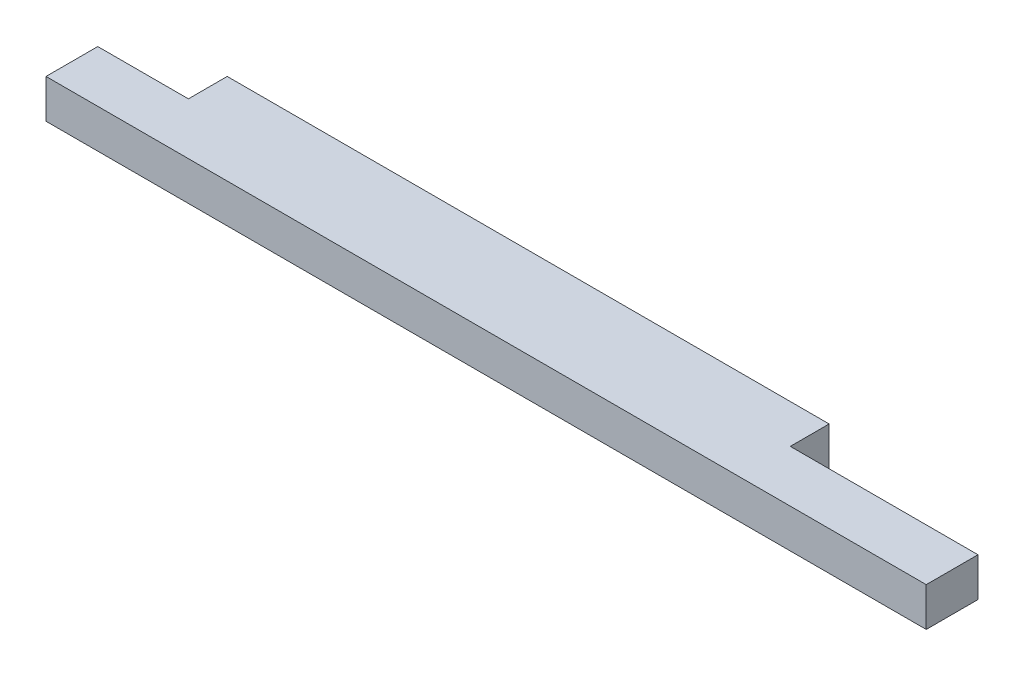
ISO-10303-21;
HEADER;
FILE_DESCRIPTION(('STEP AP214'),'2;1');
FILE_NAME('part.step','',(''),(''),'','','');
FILE_SCHEMA(('AUTOMOTIVE_DESIGN { 1 0 10303 214 1 1 1 1 }'));
ENDSEC;
DATA;
#1=APPLICATION_CONTEXT('core data for automotive mechanical design processes');
#2=APPLICATION_PROTOCOL_DEFINITION('international standard','automotive_design',2000,#1);
#3=PRODUCT_CONTEXT('',#1,'mechanical');
#4=PRODUCT('Part','Part','',(#3));
#5=PRODUCT_RELATED_PRODUCT_CATEGORY('part','',(#4));
#6=PRODUCT_DEFINITION_FORMATION('','',#4);
#7=PRODUCT_DEFINITION_CONTEXT('part definition',#1,'design');
#8=PRODUCT_DEFINITION('design','',#6,#7);
#9=PRODUCT_DEFINITION_SHAPE('','',#8);
#10=(LENGTH_UNIT() NAMED_UNIT(*) SI_UNIT(.MILLI.,.METRE.));
#11=(NAMED_UNIT(*) PLANE_ANGLE_UNIT() SI_UNIT($,.RADIAN.));
#12=(NAMED_UNIT(*) SI_UNIT($,.STERADIAN.) SOLID_ANGLE_UNIT());
#13=UNCERTAINTY_MEASURE_WITH_UNIT(LENGTH_MEASURE(1.E-05),#10,'distance_accuracy_value','');
#14=(GEOMETRIC_REPRESENTATION_CONTEXT(3) GLOBAL_UNCERTAINTY_ASSIGNED_CONTEXT((#13)) GLOBAL_UNIT_ASSIGNED_CONTEXT((#10,
#11,#12)) REPRESENTATION_CONTEXT('',''));
#15=CARTESIAN_POINT('',(0.,0.,0.));
#16=DIRECTION('',(0.,0.,1.));
#17=DIRECTION('',(1.,0.,0.));
#18=AXIS2_PLACEMENT_3D('',#15,#16,#17);
#19=CARTESIAN_POINT('',(0.,38.1,0.));
#20=DIRECTION('',(1.,0.,0.));
#21=DIRECTION('',(0.,0.,-1.));
#22=AXIS2_PLACEMENT_3D('',#19,#20,#21);
#23=PLANE('',#22);
#24=DIRECTION('',(0.,0.,1.));
#25=VECTOR('',#24,1.);
#26=CARTESIAN_POINT('',(0.,38.1,0.));
#27=LINE('',#26,#25);
#28=CARTESIAN_POINT('',(0.,38.1,-50.7999999999999));
#29=VERTEX_POINT('',#28);
#30=CARTESIAN_POINT('',(0.,38.1,0.));
#31=VERTEX_POINT('',#30);
#32=EDGE_CURVE('E118',#29,#31,#27,.T.);
#33=ORIENTED_EDGE('',*,*,#32,.F.);
#34=DIRECTION('',(0.,1.,0.));
#35=VECTOR('',#34,1.);
#36=CARTESIAN_POINT('',(0.,0.,-50.7999999999999));
#37=LINE('',#36,#35);
#38=CARTESIAN_POINT('',(0.,0.,-50.7999999999999));
#39=VERTEX_POINT('',#38);
#40=EDGE_CURVE('E106',#39,#29,#37,.T.);
#41=ORIENTED_EDGE('',*,*,#40,.F.);
#42=DIRECTION('',(0.,0.,1.));
#43=VECTOR('',#42,1.);
#44=CARTESIAN_POINT('',(0.,0.,0.));
#45=LINE('',#44,#43);
#46=CARTESIAN_POINT('',(0.,0.,0.));
#47=VERTEX_POINT('',#46);
#48=EDGE_CURVE('E116',#39,#47,#45,.T.);
#49=ORIENTED_EDGE('',*,*,#48,.T.);
#50=DIRECTION('',(0.,-1.,0.));
#51=VECTOR('',#50,1.);
#52=CARTESIAN_POINT('',(0.,38.1,0.));
#53=LINE('',#52,#51);
#54=EDGE_CURVE('E11',#31,#47,#53,.T.);
#55=ORIENTED_EDGE('',*,*,#54,.F.);
#56=EDGE_LOOP('',(#33,#41,#49,#55));
#57=FACE_BOUND('',#56,.T.);
#58=ADVANCED_FACE('F39',(#57),#23,.F.);
#59=CARTESIAN_POINT('',(0.,38.1,0.));
#60=DIRECTION('',(0.,0.,-1.));
#61=DIRECTION('',(-1.,0.,0.));
#62=AXIS2_PLACEMENT_3D('',#59,#60,#61);
#63=PLANE('',#62);
#64=DIRECTION('',(1.,0.,0.));
#65=VECTOR('',#64,1.);
#66=CARTESIAN_POINT('',(0.,0.,0.));
#67=LINE('',#66,#65);
#68=CARTESIAN_POINT('',(863.6,0.,0.));
#69=VERTEX_POINT('',#68);
#70=EDGE_CURVE('E122',#47,#69,#67,.T.);
#71=ORIENTED_EDGE('',*,*,#70,.T.);
#72=DIRECTION('',(0.,-1.,0.));
#73=VECTOR('',#72,1.);
#74=CARTESIAN_POINT('',(863.6,38.1,0.));
#75=LINE('',#74,#73);
#76=CARTESIAN_POINT('',(863.6,38.1,0.));
#77=VERTEX_POINT('',#76);
#78=EDGE_CURVE('E46',#77,#69,#75,.T.);
#79=ORIENTED_EDGE('',*,*,#78,.F.);
#80=DIRECTION('',(1.,0.,0.));
#81=VECTOR('',#80,1.);
#82=CARTESIAN_POINT('',(0.,38.1,0.));
#83=LINE('',#82,#81);
#84=EDGE_CURVE('E149',#31,#77,#83,.T.);
#85=ORIENTED_EDGE('',*,*,#84,.F.);
#86=ORIENTED_EDGE('',*,*,#54,.T.);
#87=EDGE_LOOP('',(#71,#79,#85,#86));
#88=FACE_BOUND('',#87,.T.);
#89=ADVANCED_FACE('F183',(#88),#63,.F.);
#90=CARTESIAN_POINT('',(863.6,38.1,0.));
#91=DIRECTION('',(-1.,0.,0.));
#92=DIRECTION('',(0.,0.,1.));
#93=AXIS2_PLACEMENT_3D('',#90,#91,#92);
#94=PLANE('',#93);
#95=DIRECTION('',(0.,0.,-1.));
#96=VECTOR('',#95,1.);
#97=CARTESIAN_POINT('',(863.6,0.,0.));
#98=LINE('',#97,#96);
#99=CARTESIAN_POINT('',(863.6,0.,-50.8));
#100=VERTEX_POINT('',#99);
#101=EDGE_CURVE('E125',#69,#100,#98,.T.);
#102=ORIENTED_EDGE('',*,*,#101,.T.);
#103=DIRECTION('',(0.,1.,0.));
#104=VECTOR('',#103,1.);
#105=CARTESIAN_POINT('',(863.6,0.,-50.8));
#106=LINE('',#105,#104);
#107=CARTESIAN_POINT('',(863.6,38.1,-50.8));
#108=VERTEX_POINT('',#107);
#109=EDGE_CURVE('E123',#100,#108,#106,.T.);
#110=ORIENTED_EDGE('',*,*,#109,.T.);
#111=DIRECTION('',(0.,0.,-1.));
#112=VECTOR('',#111,1.);
#113=CARTESIAN_POINT('',(863.6,38.1,0.));
#114=LINE('',#113,#112);
#115=EDGE_CURVE('E143',#77,#108,#114,.T.);
#116=ORIENTED_EDGE('',*,*,#115,.F.);
#117=ORIENTED_EDGE('',*,*,#78,.T.);
#118=EDGE_LOOP('',(#102,#110,#116,#117));
#119=FACE_BOUND('',#118,.T.);
#120=ADVANCED_FACE('F181',(#119),#94,.F.);
#121=CARTESIAN_POINT('',(0.,38.1,-88.9));
#122=DIRECTION('',(0.,0.,1.));
#123=DIRECTION('',(1.,0.,0.));
#124=AXIS2_PLACEMENT_3D('',#121,#122,#123);
#125=PLANE('',#124);
#126=DIRECTION('',(-1.,0.,0.));
#127=VECTOR('',#126,1.);
#128=CARTESIAN_POINT('',(0.,0.,-88.9));
#129=LINE('',#128,#127);
#130=CARTESIAN_POINT('',(679.45,0.,-88.8999999999999));
#131=VERTEX_POINT('',#130);
#132=CARTESIAN_POINT('',(88.9,0.,-88.9));
#133=VERTEX_POINT('',#132);
#134=EDGE_CURVE('E136',#131,#133,#129,.T.);
#135=ORIENTED_EDGE('',*,*,#134,.T.);
#136=DIRECTION('',(0.,1.,0.));
#137=VECTOR('',#136,1.);
#138=CARTESIAN_POINT('',(88.9,0.,-88.9));
#139=LINE('',#138,#137);
#140=CARTESIAN_POINT('',(88.9,38.1,-88.9));
#141=VERTEX_POINT('',#140);
#142=EDGE_CURVE('E163',#133,#141,#139,.T.);
#143=ORIENTED_EDGE('',*,*,#142,.T.);
#144=DIRECTION('',(-1.,0.,0.));
#145=VECTOR('',#144,1.);
#146=CARTESIAN_POINT('',(0.,38.1,-88.9));
#147=LINE('',#146,#145);
#148=CARTESIAN_POINT('',(679.45,38.1,-88.8999999999999));
#149=VERTEX_POINT('',#148);
#150=EDGE_CURVE('E131',#149,#141,#147,.T.);
#151=ORIENTED_EDGE('',*,*,#150,.F.);
#152=DIRECTION('',(0.,1.,0.));
#153=VECTOR('',#152,1.);
#154=CARTESIAN_POINT('',(679.45,0.,-88.8999999999999));
#155=LINE('',#154,#153);
#156=EDGE_CURVE('E154',#131,#149,#155,.T.);
#157=ORIENTED_EDGE('',*,*,#156,.F.);
#158=EDGE_LOOP('',(#135,#143,#151,#157));
#159=FACE_BOUND('',#158,.T.);
#160=ADVANCED_FACE('F176',(#159),#125,.F.);
#161=CARTESIAN_POINT('',(0.,38.1,0.));
#162=DIRECTION('',(0.,-1.,0.));
#163=DIRECTION('',(0.,0.,-1.));
#164=AXIS2_PLACEMENT_3D('',#161,#162,#163);
#165=PLANE('',#164);
#166=ORIENTED_EDGE('',*,*,#150,.T.);
#167=DIRECTION('',(0.,0.,-1.));
#168=VECTOR('',#167,1.);
#169=CARTESIAN_POINT('',(88.9,38.1,-88.9));
#170=LINE('',#169,#168);
#171=CARTESIAN_POINT('',(88.9,38.1,-50.7999999999999));
#172=VERTEX_POINT('',#171);
#173=EDGE_CURVE('E111',#172,#141,#170,.T.);
#174=ORIENTED_EDGE('',*,*,#173,.F.);
#175=DIRECTION('',(1.,0.,0.));
#176=VECTOR('',#175,1.);
#177=CARTESIAN_POINT('',(0.,38.1,-50.7999999999999));
#178=LINE('',#177,#176);
#179=EDGE_CURVE('E171',#29,#172,#178,.T.);
#180=ORIENTED_EDGE('',*,*,#179,.F.);
#181=ORIENTED_EDGE('',*,*,#32,.T.);
#182=ORIENTED_EDGE('',*,*,#84,.T.);
#183=ORIENTED_EDGE('',*,*,#115,.T.);
#184=DIRECTION('',(1.,0.,0.));
#185=VECTOR('',#184,1.);
#186=CARTESIAN_POINT('',(863.6,38.1,-50.8));
#187=LINE('',#186,#185);
#188=CARTESIAN_POINT('',(679.45,38.1,-50.8));
#189=VERTEX_POINT('',#188);
#190=EDGE_CURVE('E157',#189,#108,#187,.T.);
#191=ORIENTED_EDGE('',*,*,#190,.F.);
#192=DIRECTION('',(0.,0.,1.));
#193=VECTOR('',#192,1.);
#194=CARTESIAN_POINT('',(679.45,38.1,-88.8999999999999));
#195=LINE('',#194,#193);
#196=EDGE_CURVE('E160',#149,#189,#195,.T.);
#197=ORIENTED_EDGE('',*,*,#196,.F.);
#198=EDGE_LOOP('',(#166,#174,#180,#181,#182,#183,#191,#197));
#199=FACE_BOUND('',#198,.T.);
#200=ADVANCED_FACE('F179',(#199),#165,.F.);
#201=CARTESIAN_POINT('',(0.,0.,0.));
#202=DIRECTION('',(0.,-1.,0.));
#203=DIRECTION('',(0.,0.,-1.));
#204=AXIS2_PLACEMENT_3D('',#201,#202,#203);
#205=PLANE('',#204);
#206=DIRECTION('',(0.,0.,-1.));
#207=VECTOR('',#206,1.);
#208=CARTESIAN_POINT('',(88.9,0.,-88.9));
#209=LINE('',#208,#207);
#210=CARTESIAN_POINT('',(88.9,0.,-50.7999999999999));
#211=VERTEX_POINT('',#210);
#212=EDGE_CURVE('E53',#211,#133,#209,.T.);
#213=ORIENTED_EDGE('',*,*,#212,.T.);
#214=ORIENTED_EDGE('',*,*,#134,.F.);
#215=DIRECTION('',(0.,0.,1.));
#216=VECTOR('',#215,1.);
#217=CARTESIAN_POINT('',(679.45,0.,-88.8999999999999));
#218=LINE('',#217,#216);
#219=CARTESIAN_POINT('',(679.45,0.,-50.8));
#220=VERTEX_POINT('',#219);
#221=EDGE_CURVE('E159',#131,#220,#218,.T.);
#222=ORIENTED_EDGE('',*,*,#221,.T.);
#223=DIRECTION('',(1.,0.,0.));
#224=VECTOR('',#223,1.);
#225=CARTESIAN_POINT('',(863.6,0.,-50.8));
#226=LINE('',#225,#224);
#227=EDGE_CURVE('E61',#220,#100,#226,.T.);
#228=ORIENTED_EDGE('',*,*,#227,.T.);
#229=ORIENTED_EDGE('',*,*,#101,.F.);
#230=ORIENTED_EDGE('',*,*,#70,.F.);
#231=ORIENTED_EDGE('',*,*,#48,.F.);
#232=DIRECTION('',(1.,0.,0.));
#233=VECTOR('',#232,1.);
#234=CARTESIAN_POINT('',(0.,0.,-50.7999999999999));
#235=LINE('',#234,#233);
#236=EDGE_CURVE('E102',#39,#211,#235,.T.);
#237=ORIENTED_EDGE('',*,*,#236,.T.);
#238=EDGE_LOOP('',(#213,#214,#222,#228,#229,#230,#231,#237));
#239=FACE_BOUND('',#238,.T.);
#240=ADVANCED_FACE('F120',(#239),#205,.T.);
#241=CARTESIAN_POINT('',(863.6,0.,-50.8));
#242=DIRECTION('',(0.,0.,1.));
#243=DIRECTION('',(1.,0.,0.));
#244=AXIS2_PLACEMENT_3D('',#241,#242,#243);
#245=PLANE('',#244);
#246=ORIENTED_EDGE('',*,*,#190,.T.);
#247=ORIENTED_EDGE('',*,*,#109,.F.);
#248=ORIENTED_EDGE('',*,*,#227,.F.);
#249=DIRECTION('',(0.,1.,0.));
#250=VECTOR('',#249,1.);
#251=CARTESIAN_POINT('',(679.45,0.,-50.8));
#252=LINE('',#251,#250);
#253=EDGE_CURVE('E128',#220,#189,#252,.T.);
#254=ORIENTED_EDGE('',*,*,#253,.T.);
#255=EDGE_LOOP('',(#246,#247,#248,#254));
#256=FACE_BOUND('',#255,.T.);
#257=ADVANCED_FACE('F180',(#256),#245,.F.);
#258=CARTESIAN_POINT('',(679.45,0.,-88.8999999999999));
#259=DIRECTION('',(-1.,0.,0.));
#260=DIRECTION('',(0.,0.,1.));
#261=AXIS2_PLACEMENT_3D('',#258,#259,#260);
#262=PLANE('',#261);
#263=ORIENTED_EDGE('',*,*,#196,.T.);
#264=ORIENTED_EDGE('',*,*,#253,.F.);
#265=ORIENTED_EDGE('',*,*,#221,.F.);
#266=ORIENTED_EDGE('',*,*,#156,.T.);
#267=EDGE_LOOP('',(#263,#264,#265,#266));
#268=FACE_BOUND('',#267,.T.);
#269=ADVANCED_FACE('F178',(#268),#262,.F.);
#270=CARTESIAN_POINT('',(88.9,0.,-88.9));
#271=DIRECTION('',(1.,0.,0.));
#272=DIRECTION('',(0.,0.,-1.));
#273=AXIS2_PLACEMENT_3D('',#270,#271,#272);
#274=PLANE('',#273);
#275=ORIENTED_EDGE('',*,*,#173,.T.);
#276=ORIENTED_EDGE('',*,*,#142,.F.);
#277=ORIENTED_EDGE('',*,*,#212,.F.);
#278=DIRECTION('',(0.,1.,0.));
#279=VECTOR('',#278,1.);
#280=CARTESIAN_POINT('',(88.9,0.,-50.7999999999999));
#281=LINE('',#280,#279);
#282=EDGE_CURVE('E108',#211,#172,#281,.T.);
#283=ORIENTED_EDGE('',*,*,#282,.T.);
#284=EDGE_LOOP('',(#275,#276,#277,#283));
#285=FACE_BOUND('',#284,.T.);
#286=ADVANCED_FACE('F223',(#285),#274,.F.);
#287=CARTESIAN_POINT('',(0.,0.,-50.7999999999999));
#288=DIRECTION('',(0.,0.,1.));
#289=DIRECTION('',(1.,0.,0.));
#290=AXIS2_PLACEMENT_3D('',#287,#288,#289);
#291=PLANE('',#290);
#292=ORIENTED_EDGE('',*,*,#179,.T.);
#293=ORIENTED_EDGE('',*,*,#282,.F.);
#294=ORIENTED_EDGE('',*,*,#236,.F.);
#295=ORIENTED_EDGE('',*,*,#40,.T.);
#296=EDGE_LOOP('',(#292,#293,#294,#295));
#297=FACE_BOUND('',#296,.T.);
#298=ADVANCED_FACE('F105',(#297),#291,.F.);
#299=CLOSED_SHELL('',(#58,#89,#120,#160,#200,#240,#257,#269,#286,#298));
#300=MANIFOLD_SOLID_BREP('B2',#299);
#301=ADVANCED_BREP_SHAPE_REPRESENTATION('',(#18,#300),#14);
#302=SHAPE_DEFINITION_REPRESENTATION(#9,#301);
ENDSEC;
END-ISO-10303-21;
